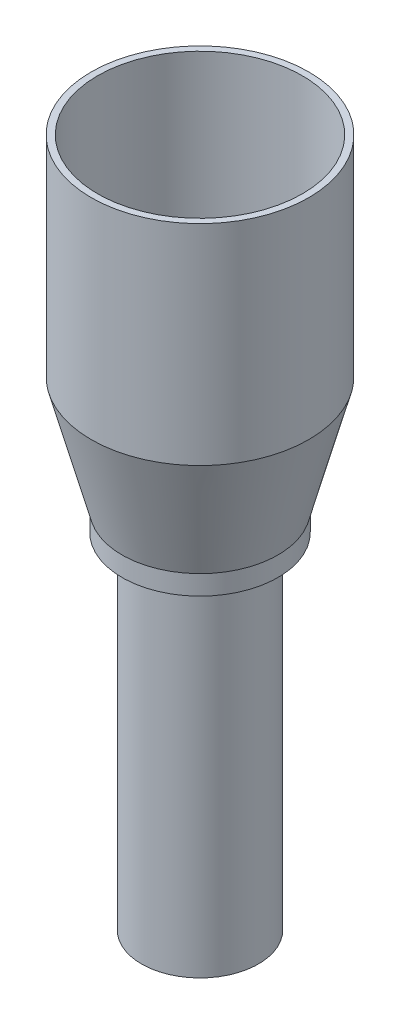
ISO-10303-21;
HEADER;
FILE_DESCRIPTION(('STEP AP214'),'2;1');
FILE_NAME('part.step','',(''),(''),'','','');
FILE_SCHEMA(('AUTOMOTIVE_DESIGN { 1 0 10303 214 1 1 1 1 }'));
ENDSEC;
DATA;
#1=APPLICATION_CONTEXT('core data for automotive mechanical design processes');
#2=APPLICATION_PROTOCOL_DEFINITION('international standard','automotive_design',2000,#1);
#3=PRODUCT_CONTEXT('',#1,'mechanical');
#4=PRODUCT('Part','Part','',(#3));
#5=PRODUCT_RELATED_PRODUCT_CATEGORY('part','',(#4));
#6=PRODUCT_DEFINITION_FORMATION('','',#4);
#7=PRODUCT_DEFINITION_CONTEXT('part definition',#1,'design');
#8=PRODUCT_DEFINITION('design','',#6,#7);
#9=PRODUCT_DEFINITION_SHAPE('','',#8);
#10=(LENGTH_UNIT() NAMED_UNIT(*) SI_UNIT(.MILLI.,.METRE.));
#11=(NAMED_UNIT(*) PLANE_ANGLE_UNIT() SI_UNIT($,.RADIAN.));
#12=(NAMED_UNIT(*) SI_UNIT($,.STERADIAN.) SOLID_ANGLE_UNIT());
#13=UNCERTAINTY_MEASURE_WITH_UNIT(LENGTH_MEASURE(1.E-05),#10,'distance_accuracy_value','');
#14=(GEOMETRIC_REPRESENTATION_CONTEXT(3) GLOBAL_UNCERTAINTY_ASSIGNED_CONTEXT((#13)) GLOBAL_UNIT_ASSIGNED_CONTEXT((#10,
#11,#12)) REPRESENTATION_CONTEXT('',''));
#15=CARTESIAN_POINT('',(0.,0.,0.));
#16=DIRECTION('',(0.,0.,1.));
#17=DIRECTION('',(1.,0.,0.));
#18=AXIS2_PLACEMENT_3D('',#15,#16,#17);
#19=CARTESIAN_POINT('',(0.,49.3633902014198,0.));
#20=DIRECTION('',(0.,1.,0.));
#21=DIRECTION('',(-1.,0.,0.));
#22=AXIS2_PLACEMENT_3D('',#19,#20,#21);
#23=CYLINDRICAL_SURFACE('',#22,8.99999999999999);
#24=CARTESIAN_POINT('',(0.,21.2789707116442,0.));
#25=DIRECTION('',(0.,1.,0.));
#26=DIRECTION('',(-1.,0.,0.));
#27=AXIS2_PLACEMENT_3D('',#24,#25,#26);
#28=CIRCLE('',#27,8.99999999999999);
#29=CARTESIAN_POINT('',(-8.99999999999999,21.2789707116442,0.));
#30=VERTEX_POINT('',#29);
#31=EDGE_CURVE('E66',#30,#30,#28,.T.);
#32=ORIENTED_EDGE('',*,*,#31,.F.);
#33=EDGE_LOOP('',(#32));
#34=FACE_BOUND('',#33,.T.);
#35=CARTESIAN_POINT('',(0.,-31.7210292883558,0.));
#36=DIRECTION('',(0.,1.,0.));
#37=DIRECTION('',(-1.,0.,0.));
#38=AXIS2_PLACEMENT_3D('',#35,#36,#37);
#39=CIRCLE('',#38,8.99999999999999);
#40=CARTESIAN_POINT('',(-8.99999999999998,-31.7210292883558,0.));
#41=VERTEX_POINT('',#40);
#42=EDGE_CURVE('E10',#41,#41,#39,.T.);
#43=ORIENTED_EDGE('',*,*,#42,.T.);
#44=EDGE_LOOP('',(#43));
#45=FACE_BOUND('',#44,.T.);
#46=ADVANCED_FACE('F32',(#34,#45),#23,.T.);
#47=CARTESIAN_POINT('',(9.,-31.7210292883558,0.));
#48=DIRECTION('',(0.,1.,0.));
#49=DIRECTION('',(-1.,0.,0.));
#50=AXIS2_PLACEMENT_3D('',#47,#48,#49);
#51=PLANE('',#50);
#52=ORIENTED_EDGE('',*,*,#42,.F.);
#53=EDGE_LOOP('',(#52));
#54=FACE_BOUND('',#53,.T.);
#55=CARTESIAN_POINT('',(0.,-31.7210292883558,0.));
#56=DIRECTION('',(0.,1.,0.));
#57=DIRECTION('',(-1.,0.,0.));
#58=AXIS2_PLACEMENT_3D('',#55,#56,#57);
#59=CIRCLE('',#58,7.99999999999999);
#60=CARTESIAN_POINT('',(-7.99999999999998,-31.7210292883558,0.));
#61=VERTEX_POINT('',#60);
#62=EDGE_CURVE('E38',#61,#61,#59,.T.);
#63=ORIENTED_EDGE('',*,*,#62,.T.);
#64=EDGE_LOOP('',(#63));
#65=FACE_BOUND('',#64,.T.);
#66=ADVANCED_FACE('F73',(#54,#65),#51,.F.);
#67=CARTESIAN_POINT('',(0.,49.3633902014198,0.));
#68=DIRECTION('',(0.,1.,0.));
#69=DIRECTION('',(-1.,0.,0.));
#70=AXIS2_PLACEMENT_3D('',#67,#68,#69);
#71=CYLINDRICAL_SURFACE('',#70,8.);
#72=ORIENTED_EDGE('',*,*,#62,.F.);
#73=EDGE_LOOP('',(#72));
#74=FACE_BOUND('',#73,.T.);
#75=CARTESIAN_POINT('',(0.,22.2789707116442,0.));
#76=DIRECTION('',(0.,1.,0.));
#77=DIRECTION('',(-1.,0.,0.));
#78=AXIS2_PLACEMENT_3D('',#75,#76,#77);
#79=CIRCLE('',#78,8.);
#80=CARTESIAN_POINT('',(-8.,22.2789707116442,0.));
#81=VERTEX_POINT('',#80);
#82=EDGE_CURVE('E42',#81,#81,#79,.T.);
#83=ORIENTED_EDGE('',*,*,#82,.T.);
#84=EDGE_LOOP('',(#83));
#85=FACE_BOUND('',#84,.T.);
#86=ADVANCED_FACE('F77',(#74,#85),#71,.F.);
#87=CARTESIAN_POINT('',(0.,42.1674193538335,0.));
#88=DIRECTION('',(0.,1.,0.));
#89=DIRECTION('',(-1.,0.,0.));
#90=AXIS2_PLACEMENT_3D('',#87,#88,#89);
#91=CONICAL_SURFACE('',#90,15.75,0.371572586229572);
#92=ORIENTED_EDGE('',*,*,#82,.F.);
#93=EDGE_LOOP('',(#92));
#94=FACE_BOUND('',#93,.T.);
#95=CARTESIAN_POINT('',(0.,42.1674193538335,0.));
#96=DIRECTION('',(0.,1.,0.));
#97=DIRECTION('',(-1.,0.,0.));
#98=AXIS2_PLACEMENT_3D('',#95,#96,#97);
#99=CIRCLE('',#98,15.75);
#100=CARTESIAN_POINT('',(-15.75,42.1674193538335,0.));
#101=VERTEX_POINT('',#100);
#102=EDGE_CURVE('E46',#101,#101,#99,.T.);
#103=ORIENTED_EDGE('',*,*,#102,.T.);
#104=EDGE_LOOP('',(#103));
#105=FACE_BOUND('',#104,.T.);
#106=ADVANCED_FACE('F82',(#94,#105),#91,.F.);
#107=CARTESIAN_POINT('',(0.,49.3633902014198,0.));
#108=DIRECTION('',(0.,1.,0.));
#109=DIRECTION('',(-1.,0.,0.));
#110=AXIS2_PLACEMENT_3D('',#107,#108,#109);
#111=CYLINDRICAL_SURFACE('',#110,15.75);
#112=ORIENTED_EDGE('',*,*,#102,.F.);
#113=EDGE_LOOP('',(#112));
#114=FACE_BOUND('',#113,.T.);
#115=CARTESIAN_POINT('',(0.,74.2789707116442,0.));
#116=DIRECTION('',(0.,1.,0.));
#117=DIRECTION('',(-1.,0.,0.));
#118=AXIS2_PLACEMENT_3D('',#115,#116,#117);
#119=CIRCLE('',#118,15.75);
#120=CARTESIAN_POINT('',(-15.75,74.2789707116442,0.));
#121=VERTEX_POINT('',#120);
#122=EDGE_CURVE('E51',#121,#121,#119,.T.);
#123=ORIENTED_EDGE('',*,*,#122,.T.);
#124=EDGE_LOOP('',(#123));
#125=FACE_BOUND('',#124,.T.);
#126=ADVANCED_FACE('F88',(#114,#125),#111,.F.);
#127=CARTESIAN_POINT('',(15.75,74.2789707116442,0.));
#128=DIRECTION('',(0.,-1.,0.));
#129=DIRECTION('',(1.,0.,0.));
#130=AXIS2_PLACEMENT_3D('',#127,#128,#129);
#131=PLANE('',#130);
#132=ORIENTED_EDGE('',*,*,#122,.F.);
#133=EDGE_LOOP('',(#132));
#134=FACE_BOUND('',#133,.T.);
#135=CARTESIAN_POINT('',(0.,74.2789707116442,0.));
#136=DIRECTION('',(0.,1.,0.));
#137=DIRECTION('',(-1.,0.,0.));
#138=AXIS2_PLACEMENT_3D('',#135,#136,#137);
#139=CIRCLE('',#138,16.75);
#140=CARTESIAN_POINT('',(-16.75,74.2789707116442,0.));
#141=VERTEX_POINT('',#140);
#142=EDGE_CURVE('E54',#141,#141,#139,.T.);
#143=ORIENTED_EDGE('',*,*,#142,.T.);
#144=EDGE_LOOP('',(#143));
#145=FACE_BOUND('',#144,.T.);
#146=ADVANCED_FACE('F92',(#134,#145),#131,.F.);
#147=CARTESIAN_POINT('',(0.,49.3633902014198,0.));
#148=DIRECTION('',(0.,1.,0.));
#149=DIRECTION('',(-1.,0.,0.));
#150=AXIS2_PLACEMENT_3D('',#147,#148,#149);
#151=CYLINDRICAL_SURFACE('',#150,16.75);
#152=ORIENTED_EDGE('',*,*,#142,.F.);
#153=EDGE_LOOP('',(#152));
#154=FACE_BOUND('',#153,.T.);
#155=CARTESIAN_POINT('',(0.,42.0359800574386,0.));
#156=DIRECTION('',(0.,1.,0.));
#157=DIRECTION('',(-1.,0.,0.));
#158=AXIS2_PLACEMENT_3D('',#155,#156,#157);
#159=CIRCLE('',#158,16.75);
#160=CARTESIAN_POINT('',(-16.75,42.0359800574386,0.));
#161=VERTEX_POINT('',#160);
#162=EDGE_CURVE('E57',#161,#161,#159,.T.);
#163=ORIENTED_EDGE('',*,*,#162,.T.);
#164=EDGE_LOOP('',(#163));
#165=FACE_BOUND('',#164,.T.);
#166=ADVANCED_FACE('F96',(#154,#165),#151,.T.);
#167=CARTESIAN_POINT('',(0.,24.2789707116442,0.));
#168=DIRECTION('',(0.,1.,0.));
#169=DIRECTION('',(-1.,0.,0.));
#170=AXIS2_PLACEMENT_3D('',#167,#168,#169);
#171=CONICAL_SURFACE('',#170,12.,0.26138023851019);
#172=ORIENTED_EDGE('',*,*,#162,.F.);
#173=EDGE_LOOP('',(#172));
#174=FACE_BOUND('',#173,.T.);
#175=CARTESIAN_POINT('',(0.,24.2789707116442,0.));
#176=DIRECTION('',(0.,1.,0.));
#177=DIRECTION('',(-1.,0.,0.));
#178=AXIS2_PLACEMENT_3D('',#175,#176,#177);
#179=CIRCLE('',#178,12.);
#180=CARTESIAN_POINT('',(-12.,24.2789707116442,0.));
#181=VERTEX_POINT('',#180);
#182=EDGE_CURVE('E60',#181,#181,#179,.T.);
#183=ORIENTED_EDGE('',*,*,#182,.T.);
#184=EDGE_LOOP('',(#183));
#185=FACE_BOUND('',#184,.T.);
#186=ADVANCED_FACE('F100',(#174,#185),#171,.T.);
#187=CARTESIAN_POINT('',(0.,49.3633902014198,0.));
#188=DIRECTION('',(0.,1.,0.));
#189=DIRECTION('',(-1.,0.,0.));
#190=AXIS2_PLACEMENT_3D('',#187,#188,#189);
#191=CYLINDRICAL_SURFACE('',#190,12.);
#192=ORIENTED_EDGE('',*,*,#182,.F.);
#193=EDGE_LOOP('',(#192));
#194=FACE_BOUND('',#193,.T.);
#195=CARTESIAN_POINT('',(0.,21.2789707116442,0.));
#196=DIRECTION('',(0.,1.,0.));
#197=DIRECTION('',(-1.,0.,0.));
#198=AXIS2_PLACEMENT_3D('',#195,#196,#197);
#199=CIRCLE('',#198,12.);
#200=CARTESIAN_POINT('',(-12.,21.2789707116442,0.));
#201=VERTEX_POINT('',#200);
#202=EDGE_CURVE('E63',#201,#201,#199,.T.);
#203=ORIENTED_EDGE('',*,*,#202,.T.);
#204=EDGE_LOOP('',(#203));
#205=FACE_BOUND('',#204,.T.);
#206=ADVANCED_FACE('F104',(#194,#205),#191,.T.);
#207=CARTESIAN_POINT('',(9.,21.2789707116442,0.));
#208=DIRECTION('',(0.,1.,0.));
#209=DIRECTION('',(-1.,0.,0.));
#210=AXIS2_PLACEMENT_3D('',#207,#208,#209);
#211=PLANE('',#210);
#212=ORIENTED_EDGE('',*,*,#202,.F.);
#213=EDGE_LOOP('',(#212));
#214=FACE_BOUND('',#213,.T.);
#215=ORIENTED_EDGE('',*,*,#31,.T.);
#216=EDGE_LOOP('',(#215));
#217=FACE_BOUND('',#216,.T.);
#218=ADVANCED_FACE('F70',(#214,#217),#211,.F.);
#219=CLOSED_SHELL('',(#46,#66,#86,#106,#126,#146,#166,#186,#206,#218));
#220=MANIFOLD_SOLID_BREP('B2',#219);
#221=ADVANCED_BREP_SHAPE_REPRESENTATION('',(#18,#220),#14);
#222=SHAPE_DEFINITION_REPRESENTATION(#9,#221);
ENDSEC;
END-ISO-10303-21;
